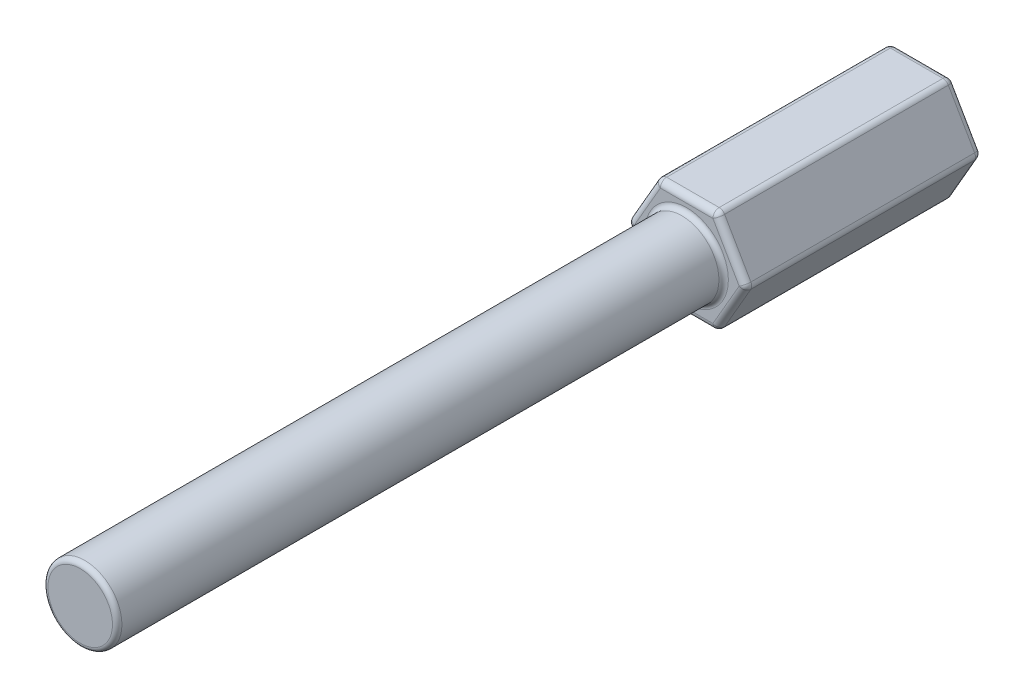
ISO-10303-21;
HEADER;
FILE_DESCRIPTION(('STEP AP214'),'2;1');
FILE_NAME('part.step','',(''),(''),'','','');
FILE_SCHEMA(('AUTOMOTIVE_DESIGN { 1 0 10303 214 1 1 1 1 }'));
ENDSEC;
DATA;
#1=APPLICATION_CONTEXT('core data for automotive mechanical design processes');
#2=APPLICATION_PROTOCOL_DEFINITION('international standard','automotive_design',2000,#1);
#3=PRODUCT_CONTEXT('',#1,'mechanical');
#4=PRODUCT('Part','Part','',(#3));
#5=PRODUCT_RELATED_PRODUCT_CATEGORY('part','',(#4));
#6=PRODUCT_DEFINITION_FORMATION('','',#4);
#7=PRODUCT_DEFINITION_CONTEXT('part definition',#1,'design');
#8=PRODUCT_DEFINITION('design','',#6,#7);
#9=PRODUCT_DEFINITION_SHAPE('','',#8);
#10=(LENGTH_UNIT() NAMED_UNIT(*) SI_UNIT(.MILLI.,.METRE.));
#11=(NAMED_UNIT(*) PLANE_ANGLE_UNIT() SI_UNIT($,.RADIAN.));
#12=(NAMED_UNIT(*) SI_UNIT($,.STERADIAN.) SOLID_ANGLE_UNIT());
#13=UNCERTAINTY_MEASURE_WITH_UNIT(LENGTH_MEASURE(1.E-05),#10,'distance_accuracy_value','');
#14=(GEOMETRIC_REPRESENTATION_CONTEXT(3) GLOBAL_UNCERTAINTY_ASSIGNED_CONTEXT((#13)) GLOBAL_UNIT_ASSIGNED_CONTEXT((#10,
#11,#12)) REPRESENTATION_CONTEXT('',''));
#15=CARTESIAN_POINT('',(0.,0.,0.));
#16=DIRECTION('',(0.,0.,1.));
#17=DIRECTION('',(1.,0.,0.));
#18=AXIS2_PLACEMENT_3D('',#15,#16,#17);
#19=CARTESIAN_POINT('',(-2.41050954265034,-4.175125,19.05));
#20=DIRECTION('',(0.,1.,0.));
#21=DIRECTION('',(-1.,0.,0.));
#22=AXIS2_PLACEMENT_3D('',#19,#20,#21);
#23=PLANE('',#22);
#24=DIRECTION('',(1.,0.,0.));
#25=VECTOR('',#24,1.);
#26=CARTESIAN_POINT('',(-2.41050954265034,-4.175125,0.508000000000002));
#27=LINE('',#26,#25);
#28=CARTESIAN_POINT('',(-2.11721560590201,-4.175125,0.508000000000002));
#29=VERTEX_POINT('',#28);
#30=CARTESIAN_POINT('',(2.11721560590201,-4.175125,0.508000000000002));
#31=VERTEX_POINT('',#30);
#32=EDGE_CURVE('E403',#29,#31,#27,.T.);
#33=ORIENTED_EDGE('',*,*,#32,.T.);
#34=DIRECTION('',(0.,0.,-1.));
#35=VECTOR('',#34,1.);
#36=CARTESIAN_POINT('',(2.11721560590201,-4.175125,19.05));
#37=LINE('',#36,#35);
#38=CARTESIAN_POINT('',(2.11721560590201,-4.175125,18.542));
#39=VERTEX_POINT('',#38);
#40=EDGE_CURVE('E217',#31,#39,#37,.F.);
#41=ORIENTED_EDGE('',*,*,#40,.T.);
#42=DIRECTION('',(1.,0.,0.));
#43=VECTOR('',#42,1.);
#44=CARTESIAN_POINT('',(-2.41050954265034,-4.175125,18.542));
#45=LINE('',#44,#43);
#46=CARTESIAN_POINT('',(-2.11721560590201,-4.175125,18.542));
#47=VERTEX_POINT('',#46);
#48=EDGE_CURVE('E361',#39,#47,#45,.F.);
#49=ORIENTED_EDGE('',*,*,#48,.T.);
#50=DIRECTION('',(0.,0.,-1.));
#51=VECTOR('',#50,1.);
#52=CARTESIAN_POINT('',(-2.11721560590201,-4.175125,19.05));
#53=LINE('',#52,#51);
#54=EDGE_CURVE('E215',#47,#29,#53,.T.);
#55=ORIENTED_EDGE('',*,*,#54,.T.);
#56=EDGE_LOOP('',(#33,#41,#49,#55));
#57=FACE_BOUND('',#56,.T.);
#58=ADVANCED_FACE('F36',(#57),#23,.F.);
#59=CARTESIAN_POINT('',(2.41050954265034,-4.175125,19.05));
#60=DIRECTION('',(-0.866025403784439,0.5,0.));
#61=DIRECTION('',(-0.5,-0.866025403784439,0.));
#62=AXIS2_PLACEMENT_3D('',#59,#60,#61);
#63=PLANE('',#62);
#64=DIRECTION('',(0.5,0.866025403784439,0.));
#65=VECTOR('',#64,1.);
#66=CARTESIAN_POINT('',(2.41050954265034,-4.175125,0.508000000000002));
#67=LINE('',#66,#65);
#68=CARTESIAN_POINT('',(2.5571565110245,-3.921125,0.508000000000002));
#69=VERTEX_POINT('',#68);
#70=CARTESIAN_POINT('',(4.67437211692651,-0.253999999999999,0.508000000000002));
#71=VERTEX_POINT('',#70);
#72=EDGE_CURVE('E193',#69,#71,#67,.T.);
#73=ORIENTED_EDGE('',*,*,#72,.T.);
#74=DIRECTION('',(0.,0.,-1.));
#75=VECTOR('',#74,1.);
#76=CARTESIAN_POINT('',(4.67437211692651,-0.254,19.05));
#77=LINE('',#76,#75);
#78=CARTESIAN_POINT('',(4.67437211692651,-0.253999999999999,18.542));
#79=VERTEX_POINT('',#78);
#80=EDGE_CURVE('E213',#71,#79,#77,.F.);
#81=ORIENTED_EDGE('',*,*,#80,.T.);
#82=DIRECTION('',(0.5,0.866025403784439,0.));
#83=VECTOR('',#82,1.);
#84=CARTESIAN_POINT('',(2.41050954265034,-4.175125,18.542));
#85=LINE('',#84,#83);
#86=CARTESIAN_POINT('',(2.5571565110245,-3.921125,18.542));
#87=VERTEX_POINT('',#86);
#88=EDGE_CURVE('E378',#79,#87,#85,.F.);
#89=ORIENTED_EDGE('',*,*,#88,.T.);
#90=DIRECTION('',(0.,0.,-1.));
#91=VECTOR('',#90,1.);
#92=CARTESIAN_POINT('',(2.5571565110245,-3.921125,19.05));
#93=LINE('',#92,#91);
#94=EDGE_CURVE('E211',#87,#69,#93,.T.);
#95=ORIENTED_EDGE('',*,*,#94,.T.);
#96=EDGE_LOOP('',(#73,#81,#89,#95));
#97=FACE_BOUND('',#96,.T.);
#98=ADVANCED_FACE('F380',(#97),#63,.F.);
#99=CARTESIAN_POINT('',(4.82101908530067,0.,19.05));
#100=DIRECTION('',(-0.866025403784439,-0.5,0.));
#101=DIRECTION('',(0.5,-0.866025403784439,0.));
#102=AXIS2_PLACEMENT_3D('',#99,#100,#101);
#103=PLANE('',#102);
#104=DIRECTION('',(-0.5,0.866025403784439,0.));
#105=VECTOR('',#104,1.);
#106=CARTESIAN_POINT('',(4.82101908530067,0.,0.508000000000002));
#107=LINE('',#106,#105);
#108=CARTESIAN_POINT('',(4.67437211692651,0.254,0.508000000000002));
#109=VERTEX_POINT('',#108);
#110=CARTESIAN_POINT('',(2.5571565110245,3.921125,0.508000000000002));
#111=VERTEX_POINT('',#110);
#112=EDGE_CURVE('E399',#109,#111,#107,.T.);
#113=ORIENTED_EDGE('',*,*,#112,.T.);
#114=DIRECTION('',(0.,0.,-1.));
#115=VECTOR('',#114,1.);
#116=CARTESIAN_POINT('',(2.5571565110245,3.921125,19.05));
#117=LINE('',#116,#115);
#118=CARTESIAN_POINT('',(2.5571565110245,3.921125,18.542));
#119=VERTEX_POINT('',#118);
#120=EDGE_CURVE('E209',#111,#119,#117,.F.);
#121=ORIENTED_EDGE('',*,*,#120,.T.);
#122=DIRECTION('',(-0.5,0.866025403784439,0.));
#123=VECTOR('',#122,1.);
#124=CARTESIAN_POINT('',(4.82101908530067,0.,18.542));
#125=LINE('',#124,#123);
#126=CARTESIAN_POINT('',(4.67437211692651,0.254,18.542));
#127=VERTEX_POINT('',#126);
#128=EDGE_CURVE('E396',#119,#127,#125,.F.);
#129=ORIENTED_EDGE('',*,*,#128,.T.);
#130=DIRECTION('',(0.,0.,-1.));
#131=VECTOR('',#130,1.);
#132=CARTESIAN_POINT('',(4.67437211692651,0.254,19.05));
#133=LINE('',#132,#131);
#134=EDGE_CURVE('E207',#127,#109,#133,.T.);
#135=ORIENTED_EDGE('',*,*,#134,.T.);
#136=EDGE_LOOP('',(#113,#121,#129,#135));
#137=FACE_BOUND('',#136,.T.);
#138=ADVANCED_FACE('F447',(#137),#103,.F.);
#139=CARTESIAN_POINT('',(2.41050954265034,4.175125,19.05));
#140=DIRECTION('',(0.,-1.,0.));
#141=DIRECTION('',(1.,0.,0.));
#142=AXIS2_PLACEMENT_3D('',#139,#140,#141);
#143=PLANE('',#142);
#144=DIRECTION('',(-1.,0.,0.));
#145=VECTOR('',#144,1.);
#146=CARTESIAN_POINT('',(2.41050954265034,4.175125,18.542));
#147=LINE('',#146,#145);
#148=CARTESIAN_POINT('',(-2.11721560590201,4.175125,18.542));
#149=VERTEX_POINT('',#148);
#150=CARTESIAN_POINT('',(2.11721560590201,4.175125,18.542));
#151=VERTEX_POINT('',#150);
#152=EDGE_CURVE('E406',#149,#151,#147,.F.);
#153=ORIENTED_EDGE('',*,*,#152,.T.);
#154=DIRECTION('',(0.,0.,-1.));
#155=VECTOR('',#154,1.);
#156=CARTESIAN_POINT('',(2.11721560590201,4.175125,19.05));
#157=LINE('',#156,#155);
#158=CARTESIAN_POINT('',(2.11721560590201,4.175125,0.508000000000002));
#159=VERTEX_POINT('',#158);
#160=EDGE_CURVE('E205',#151,#159,#157,.T.);
#161=ORIENTED_EDGE('',*,*,#160,.T.);
#162=DIRECTION('',(-1.,0.,0.));
#163=VECTOR('',#162,1.);
#164=CARTESIAN_POINT('',(2.41050954265034,4.175125,0.508000000000002));
#165=LINE('',#164,#163);
#166=CARTESIAN_POINT('',(-2.11721560590201,4.175125,0.508000000000002));
#167=VERTEX_POINT('',#166);
#168=EDGE_CURVE('E409',#159,#167,#165,.T.);
#169=ORIENTED_EDGE('',*,*,#168,.T.);
#170=DIRECTION('',(0.,0.,-1.));
#171=VECTOR('',#170,1.);
#172=CARTESIAN_POINT('',(-2.11721560590201,4.175125,19.05));
#173=LINE('',#172,#171);
#174=EDGE_CURVE('E198',#167,#149,#173,.F.);
#175=ORIENTED_EDGE('',*,*,#174,.T.);
#176=EDGE_LOOP('',(#153,#161,#169,#175));
#177=FACE_BOUND('',#176,.T.);
#178=ADVANCED_FACE('F414',(#177),#143,.F.);
#179=CARTESIAN_POINT('',(-2.41050954265034,4.175125,19.05));
#180=DIRECTION('',(0.866025403784439,-0.5,0.));
#181=DIRECTION('',(0.5,0.866025403784439,0.));
#182=AXIS2_PLACEMENT_3D('',#179,#180,#181);
#183=PLANE('',#182);
#184=DIRECTION('',(-0.5,-0.866025403784439,0.));
#185=VECTOR('',#184,1.);
#186=CARTESIAN_POINT('',(-2.41050954265034,4.175125,18.542));
#187=LINE('',#186,#185);
#188=CARTESIAN_POINT('',(-4.67437211692651,0.254000000000002,18.542));
#189=VERTEX_POINT('',#188);
#190=CARTESIAN_POINT('',(-2.5571565110245,3.921125,18.542));
#191=VERTEX_POINT('',#190);
#192=EDGE_CURVE('E261',#189,#191,#187,.F.);
#193=ORIENTED_EDGE('',*,*,#192,.T.);
#194=DIRECTION('',(0.,0.,-1.));
#195=VECTOR('',#194,1.);
#196=CARTESIAN_POINT('',(-2.5571565110245,3.921125,19.05));
#197=LINE('',#196,#195);
#198=CARTESIAN_POINT('',(-2.5571565110245,3.921125,0.508000000000002));
#199=VERTEX_POINT('',#198);
#200=EDGE_CURVE('E11',#191,#199,#197,.T.);
#201=ORIENTED_EDGE('',*,*,#200,.T.);
#202=DIRECTION('',(-0.5,-0.866025403784439,0.));
#203=VECTOR('',#202,1.);
#204=CARTESIAN_POINT('',(-2.41050954265034,4.175125,0.508000000000002));
#205=LINE('',#204,#203);
#206=CARTESIAN_POINT('',(-4.67437211692651,0.254000000000002,0.508000000000002));
#207=VERTEX_POINT('',#206);
#208=EDGE_CURVE('E262',#199,#207,#205,.T.);
#209=ORIENTED_EDGE('',*,*,#208,.T.);
#210=DIRECTION('',(0.,0.,-1.));
#211=VECTOR('',#210,1.);
#212=CARTESIAN_POINT('',(-4.67437211692651,0.254000000000002,19.05));
#213=LINE('',#212,#211);
#214=EDGE_CURVE('E45',#207,#189,#213,.F.);
#215=ORIENTED_EDGE('',*,*,#214,.T.);
#216=EDGE_LOOP('',(#193,#201,#209,#215));
#217=FACE_BOUND('',#216,.T.);
#218=ADVANCED_FACE('F260',(#217),#183,.F.);
#219=CARTESIAN_POINT('',(-4.82101908530067,0.,19.05));
#220=DIRECTION('',(0.866025403784439,0.5,0.));
#221=DIRECTION('',(-0.5,0.866025403784439,0.));
#222=AXIS2_PLACEMENT_3D('',#219,#220,#221);
#223=PLANE('',#222);
#224=DIRECTION('',(0.5,-0.866025403784439,0.));
#225=VECTOR('',#224,1.);
#226=CARTESIAN_POINT('',(-4.82101908530067,0.,0.508000000000002));
#227=LINE('',#226,#225);
#228=CARTESIAN_POINT('',(-4.67437211692651,-0.253999999999998,0.508000000000002));
#229=VERTEX_POINT('',#228);
#230=CARTESIAN_POINT('',(-2.5571565110245,-3.921125,0.508000000000002));
#231=VERTEX_POINT('',#230);
#232=EDGE_CURVE('E170',#229,#231,#227,.T.);
#233=ORIENTED_EDGE('',*,*,#232,.T.);
#234=DIRECTION('',(0.,0.,-1.));
#235=VECTOR('',#234,1.);
#236=CARTESIAN_POINT('',(-2.5571565110245,-3.921125,19.05));
#237=LINE('',#236,#235);
#238=CARTESIAN_POINT('',(-2.5571565110245,-3.921125,18.542));
#239=VERTEX_POINT('',#238);
#240=EDGE_CURVE('E221',#231,#239,#237,.F.);
#241=ORIENTED_EDGE('',*,*,#240,.T.);
#242=DIRECTION('',(0.5,-0.866025403784439,0.));
#243=VECTOR('',#242,1.);
#244=CARTESIAN_POINT('',(-4.82101908530067,0.,18.542));
#245=LINE('',#244,#243);
#246=CARTESIAN_POINT('',(-4.67437211692651,-0.253999999999998,18.542));
#247=VERTEX_POINT('',#246);
#248=EDGE_CURVE('E271',#239,#247,#245,.F.);
#249=ORIENTED_EDGE('',*,*,#248,.T.);
#250=DIRECTION('',(0.,0.,-1.));
#251=VECTOR('',#250,1.);
#252=CARTESIAN_POINT('',(-4.67437211692651,-0.253999999999998,19.05));
#253=LINE('',#252,#251);
#254=EDGE_CURVE('E219',#247,#229,#253,.T.);
#255=ORIENTED_EDGE('',*,*,#254,.T.);
#256=EDGE_LOOP('',(#233,#241,#249,#255));
#257=FACE_BOUND('',#256,.T.);
#258=ADVANCED_FACE('F335',(#257),#223,.F.);
#259=CARTESIAN_POINT('',(0.,0.,19.05));
#260=DIRECTION('',(0.,0.,1.));
#261=DIRECTION('',(1.,0.,0.));
#262=AXIS2_PLACEMENT_3D('',#259,#260,#261);
#263=PLANE('',#262);
#264=DIRECTION('',(1.,0.,0.));
#265=VECTOR('',#264,1.);
#266=CARTESIAN_POINT('',(2.41050954265034,-3.667125,19.05));
#267=LINE('',#266,#265);
#268=CARTESIAN_POINT('',(-2.11721560590201,-3.667125,19.05));
#269=VERTEX_POINT('',#268);
#270=CARTESIAN_POINT('',(2.11721560590201,-3.667125,19.05));
#271=VERTEX_POINT('',#270);
#272=EDGE_CURVE('E282',#269,#271,#267,.T.);
#273=ORIENTED_EDGE('',*,*,#272,.T.);
#274=DIRECTION('',(0.5,0.866025403784439,0.));
#275=VECTOR('',#274,1.);
#276=CARTESIAN_POINT('',(4.38107818017818,0.254000000000001,19.05));
#277=LINE('',#276,#275);
#278=CARTESIAN_POINT('',(4.23443121180401,0.,19.05));
#279=VERTEX_POINT('',#278);
#280=EDGE_CURVE('E288',#271,#279,#277,.T.);
#281=ORIENTED_EDGE('',*,*,#280,.T.);
#282=DIRECTION('',(-0.5,0.866025403784439,0.));
#283=VECTOR('',#282,1.);
#284=CARTESIAN_POINT('',(1.97056863752784,3.921125,19.05));
#285=LINE('',#284,#283);
#286=CARTESIAN_POINT('',(2.11721560590201,3.667125,19.05));
#287=VERTEX_POINT('',#286);
#288=EDGE_CURVE('E285',#279,#287,#285,.T.);
#289=ORIENTED_EDGE('',*,*,#288,.T.);
#290=DIRECTION('',(-1.,0.,0.));
#291=VECTOR('',#290,1.);
#292=CARTESIAN_POINT('',(-2.41050954265034,3.667125,19.05));
#293=LINE('',#292,#291);
#294=CARTESIAN_POINT('',(-2.11721560590201,3.667125,19.05));
#295=VERTEX_POINT('',#294);
#296=EDGE_CURVE('E279',#287,#295,#293,.T.);
#297=ORIENTED_EDGE('',*,*,#296,.T.);
#298=DIRECTION('',(-0.5,-0.866025403784439,0.));
#299=VECTOR('',#298,1.);
#300=CARTESIAN_POINT('',(-4.38107818017818,-0.253999999999998,19.05));
#301=LINE('',#300,#299);
#302=CARTESIAN_POINT('',(-4.23443121180401,0.,19.05));
#303=VERTEX_POINT('',#302);
#304=EDGE_CURVE('E277',#295,#303,#301,.T.);
#305=ORIENTED_EDGE('',*,*,#304,.T.);
#306=DIRECTION('',(0.5,-0.866025403784439,0.));
#307=VECTOR('',#306,1.);
#308=CARTESIAN_POINT('',(-1.97056863752784,-3.921125,19.05));
#309=LINE('',#308,#307);
#310=EDGE_CURVE('E269',#303,#269,#309,.T.);
#311=ORIENTED_EDGE('',*,*,#310,.T.);
#312=EDGE_LOOP('',(#273,#281,#289,#297,#305,#311));
#313=FACE_BOUND('',#312,.T.);
#314=CARTESIAN_POINT('',(0.,0.,19.05));
#315=DIRECTION('',(0.,0.,1.));
#316=DIRECTION('',(1.,0.,0.));
#317=AXIS2_PLACEMENT_3D('',#314,#315,#316);
#318=CIRCLE('',#317,3.3655);
#319=CARTESIAN_POINT('',(3.3655,0.,19.05));
#320=VERTEX_POINT('',#319);
#321=EDGE_CURVE('E382',#320,#320,#318,.F.);
#322=ORIENTED_EDGE('',*,*,#321,.T.);
#323=EDGE_LOOP('',(#322));
#324=FACE_BOUND('',#323,.T.);
#325=ADVANCED_FACE('F353',(#313,#324),#263,.T.);
#326=CARTESIAN_POINT('',(0.,0.,0.));
#327=DIRECTION('',(0.,0.,1.));
#328=DIRECTION('',(1.,0.,0.));
#329=AXIS2_PLACEMENT_3D('',#326,#327,#328);
#330=PLANE('',#329);
#331=DIRECTION('',(-0.5,0.866025403784439,0.));
#332=VECTOR('',#331,1.);
#333=CARTESIAN_POINT('',(3.17582340885301,1.8335625,0.));
#334=LINE('',#333,#332);
#335=CARTESIAN_POINT('',(2.11721560590201,3.667125,0.));
#336=VERTEX_POINT('',#335);
#337=CARTESIAN_POINT('',(4.23443121180401,0.,0.));
#338=VERTEX_POINT('',#337);
#339=EDGE_CURVE('E392',#336,#338,#334,.F.);
#340=ORIENTED_EDGE('',*,*,#339,.T.);
#341=DIRECTION('',(0.5,0.866025403784439,0.));
#342=VECTOR('',#341,1.);
#343=CARTESIAN_POINT('',(3.17582340885301,-1.8335625,0.));
#344=LINE('',#343,#342);
#345=CARTESIAN_POINT('',(2.11721560590201,-3.667125,0.));
#346=VERTEX_POINT('',#345);
#347=EDGE_CURVE('E394',#338,#346,#344,.F.);
#348=ORIENTED_EDGE('',*,*,#347,.T.);
#349=DIRECTION('',(1.,0.,0.));
#350=VECTOR('',#349,1.);
#351=CARTESIAN_POINT('',(0.,-3.667125,0.));
#352=LINE('',#351,#350);
#353=CARTESIAN_POINT('',(-2.11721560590201,-3.667125,0.));
#354=VERTEX_POINT('',#353);
#355=EDGE_CURVE('E187',#346,#354,#352,.F.);
#356=ORIENTED_EDGE('',*,*,#355,.T.);
#357=DIRECTION('',(0.5,-0.866025403784439,0.));
#358=VECTOR('',#357,1.);
#359=CARTESIAN_POINT('',(-3.17582340885301,-1.8335625,0.));
#360=LINE('',#359,#358);
#361=CARTESIAN_POINT('',(-4.23443121180401,0.,0.));
#362=VERTEX_POINT('',#361);
#363=EDGE_CURVE('E167',#354,#362,#360,.F.);
#364=ORIENTED_EDGE('',*,*,#363,.T.);
#365=DIRECTION('',(-0.5,-0.866025403784439,0.));
#366=VECTOR('',#365,1.);
#367=CARTESIAN_POINT('',(-3.17582340885301,1.8335625,0.));
#368=LINE('',#367,#366);
#369=CARTESIAN_POINT('',(-2.11721560590201,3.667125,0.));
#370=VERTEX_POINT('',#369);
#371=EDGE_CURVE('E183',#362,#370,#368,.F.);
#372=ORIENTED_EDGE('',*,*,#371,.T.);
#373=DIRECTION('',(-1.,0.,0.));
#374=VECTOR('',#373,1.);
#375=CARTESIAN_POINT('',(0.,3.667125,0.));
#376=LINE('',#375,#374);
#377=EDGE_CURVE('E188',#370,#336,#376,.F.);
#378=ORIENTED_EDGE('',*,*,#377,.T.);
#379=EDGE_LOOP('',(#340,#348,#356,#364,#372,#378));
#380=FACE_BOUND('',#379,.T.);
#381=ADVANCED_FACE('F181',(#380),#330,.F.);
#382=CARTESIAN_POINT('',(0.,0.,67.945));
#383=DIRECTION('',(0.,0.,-1.));
#384=DIRECTION('',(-1.,0.,0.));
#385=AXIS2_PLACEMENT_3D('',#382,#383,#384);
#386=CYLINDRICAL_SURFACE('',#385,2.9845);
#387=CARTESIAN_POINT('',(0.,0.,19.431));
#388=DIRECTION('',(0.,0.,1.));
#389=DIRECTION('',(1.,0.,0.));
#390=AXIS2_PLACEMENT_3D('',#387,#388,#389);
#391=CIRCLE('',#390,2.9845);
#392=CARTESIAN_POINT('',(2.9845,0.,19.431));
#393=VERTEX_POINT('',#392);
#394=EDGE_CURVE('E386',#393,#393,#391,.T.);
#395=ORIENTED_EDGE('',*,*,#394,.T.);
#396=EDGE_LOOP('',(#395));
#397=FACE_BOUND('',#396,.T.);
#398=CARTESIAN_POINT('',(0.,0.,67.564));
#399=DIRECTION('',(0.,0.,1.));
#400=DIRECTION('',(1.,0.,0.));
#401=AXIS2_PLACEMENT_3D('',#398,#399,#400);
#402=CIRCLE('',#401,2.9845);
#403=CARTESIAN_POINT('',(2.9845,0.,67.564));
#404=VERTEX_POINT('',#403);
#405=EDGE_CURVE('E847',#404,#404,#402,.F.);
#406=ORIENTED_EDGE('',*,*,#405,.T.);
#407=EDGE_LOOP('',(#406));
#408=FACE_BOUND('',#407,.T.);
#409=ADVANCED_FACE('F678',(#397,#408),#386,.T.);
#410=CARTESIAN_POINT('',(0.,0.,67.945));
#411=DIRECTION('',(0.,0.,1.));
#412=DIRECTION('',(1.,0.,0.));
#413=AXIS2_PLACEMENT_3D('',#410,#411,#412);
#414=PLANE('',#413);
#415=CARTESIAN_POINT('',(0.,0.,67.945));
#416=DIRECTION('',(0.,0.,1.));
#417=DIRECTION('',(1.,0.,0.));
#418=AXIS2_PLACEMENT_3D('',#415,#416,#417);
#419=CIRCLE('',#418,2.6035);
#420=CARTESIAN_POINT('',(2.6035,0.,67.945));
#421=VERTEX_POINT('',#420);
#422=EDGE_CURVE('E231',#421,#421,#419,.T.);
#423=ORIENTED_EDGE('',*,*,#422,.T.);
#424=EDGE_LOOP('',(#423));
#425=FACE_BOUND('',#424,.T.);
#426=ADVANCED_FACE('F480',(#425),#414,.T.);
#427=CARTESIAN_POINT('',(0.,0.,67.564));
#428=DIRECTION('',(0.,0.,1.));
#429=DIRECTION('',(1.,0.,0.));
#430=AXIS2_PLACEMENT_3D('',#427,#428,#429);
#431=TOROIDAL_SURFACE('',#430,2.6035,0.381);
#432=ORIENTED_EDGE('',*,*,#405,.F.);
#433=EDGE_LOOP('',(#432));
#434=FACE_BOUND('',#433,.T.);
#435=ORIENTED_EDGE('',*,*,#422,.F.);
#436=EDGE_LOOP('',(#435));
#437=FACE_BOUND('',#436,.T.);
#438=ADVANCED_FACE('F476',(#434,#437),#431,.T.);
#439=CARTESIAN_POINT('',(0.,0.,19.431));
#440=DIRECTION('',(0.,0.,1.));
#441=DIRECTION('',(1.,0.,0.));
#442=AXIS2_PLACEMENT_3D('',#439,#440,#441);
#443=TOROIDAL_SURFACE('',#442,3.3655,0.381);
#444=ORIENTED_EDGE('',*,*,#321,.F.);
#445=EDGE_LOOP('',(#444));
#446=FACE_BOUND('',#445,.T.);
#447=ORIENTED_EDGE('',*,*,#394,.F.);
#448=EDGE_LOOP('',(#447));
#449=FACE_BOUND('',#448,.T.);
#450=ADVANCED_FACE('F479',(#446,#449),#443,.F.);
#451=CARTESIAN_POINT('',(-1.97056863752784,3.921125,0.508000000000002));
#452=DIRECTION('',(-0.5,-0.866025403784439,0.));
#453=DIRECTION('',(0.866025403784439,-0.5,0.));
#454=AXIS2_PLACEMENT_3D('',#451,#452,#453);
#455=CYLINDRICAL_SURFACE('',#454,0.508);
#456=ORIENTED_EDGE('',*,*,#208,.F.);
#457=CARTESIAN_POINT('',(-2.11721560590201,3.667125,0.508000000000002));
#458=DIRECTION('',(-0.5,-0.866025403784439,0.));
#459=DIRECTION('',(0.866025403784439,-0.5,0.));
#460=AXIS2_PLACEMENT_3D('',#457,#458,#459);
#461=CIRCLE('',#460,0.508);
#462=EDGE_CURVE('E192',#199,#370,#461,.T.);
#463=ORIENTED_EDGE('',*,*,#462,.T.);
#464=ORIENTED_EDGE('',*,*,#371,.F.);
#465=CARTESIAN_POINT('',(-4.23443121180401,0.,0.508000000000002));
#466=DIRECTION('',(-0.5,-0.866025403784439,0.));
#467=DIRECTION('',(0.866025403784439,-0.5,0.));
#468=AXIS2_PLACEMENT_3D('',#465,#466,#467);
#469=CIRCLE('',#468,0.508);
#470=EDGE_CURVE('E53',#362,#207,#469,.F.);
#471=ORIENTED_EDGE('',*,*,#470,.T.);
#472=EDGE_LOOP('',(#456,#463,#464,#471));
#473=FACE_BOUND('',#472,.T.);
#474=ADVANCED_FACE('F190',(#473),#455,.T.);
#475=CARTESIAN_POINT('',(-4.38107818017818,0.254000000000002,0.508000000000002));
#476=DIRECTION('',(0.5,-0.866025403784439,0.));
#477=DIRECTION('',(0.866025403784439,0.5,0.));
#478=AXIS2_PLACEMENT_3D('',#475,#476,#477);
#479=CYLINDRICAL_SURFACE('',#478,0.508);
#480=ORIENTED_EDGE('',*,*,#363,.F.);
#481=CARTESIAN_POINT('',(-2.11721560590201,-3.667125,0.508000000000002));
#482=DIRECTION('',(0.5,-0.866025403784439,0.));
#483=DIRECTION('',(0.866025403784439,0.5,0.));
#484=AXIS2_PLACEMENT_3D('',#481,#482,#483);
#485=CIRCLE('',#484,0.508);
#486=EDGE_CURVE('E174',#354,#231,#485,.F.);
#487=ORIENTED_EDGE('',*,*,#486,.T.);
#488=ORIENTED_EDGE('',*,*,#232,.F.);
#489=CARTESIAN_POINT('',(-4.23443121180401,0.,0.508000000000002));
#490=DIRECTION('',(0.5,-0.866025403784439,0.));
#491=DIRECTION('',(0.866025403784439,0.5,0.));
#492=AXIS2_PLACEMENT_3D('',#489,#490,#491);
#493=CIRCLE('',#492,0.508);
#494=EDGE_CURVE('E164',#229,#362,#493,.T.);
#495=ORIENTED_EDGE('',*,*,#494,.T.);
#496=EDGE_LOOP('',(#480,#487,#488,#495));
#497=FACE_BOUND('',#496,.T.);
#498=ADVANCED_FACE('F166',(#497),#479,.T.);
#499=CARTESIAN_POINT('',(2.41050954265034,3.667125,0.508000000000002));
#500=DIRECTION('',(-1.,0.,0.));
#501=DIRECTION('',(0.,-1.,0.));
#502=AXIS2_PLACEMENT_3D('',#499,#500,#501);
#503=CYLINDRICAL_SURFACE('',#502,0.508);
#504=ORIENTED_EDGE('',*,*,#168,.F.);
#505=CARTESIAN_POINT('',(2.11721560590201,3.667125,0.508000000000002));
#506=DIRECTION('',(-1.,0.,0.));
#507=DIRECTION('',(0.,-1.,0.));
#508=AXIS2_PLACEMENT_3D('',#505,#506,#507);
#509=CIRCLE('',#508,0.508);
#510=EDGE_CURVE('E308',#159,#336,#509,.T.);
#511=ORIENTED_EDGE('',*,*,#510,.T.);
#512=ORIENTED_EDGE('',*,*,#377,.F.);
#513=CARTESIAN_POINT('',(-2.11721560590201,3.667125,0.508000000000002));
#514=DIRECTION('',(-1.,0.,0.));
#515=DIRECTION('',(0.,-1.,0.));
#516=AXIS2_PLACEMENT_3D('',#513,#514,#515);
#517=CIRCLE('',#516,0.508);
#518=EDGE_CURVE('E306',#370,#167,#517,.F.);
#519=ORIENTED_EDGE('',*,*,#518,.T.);
#520=EDGE_LOOP('',(#504,#511,#512,#519));
#521=FACE_BOUND('',#520,.T.);
#522=ADVANCED_FACE('F491',(#521),#503,.T.);
#523=CARTESIAN_POINT('',(-2.41050954265034,-3.667125,0.508000000000002));
#524=DIRECTION('',(1.,0.,0.));
#525=DIRECTION('',(0.,1.,0.));
#526=AXIS2_PLACEMENT_3D('',#523,#524,#525);
#527=CYLINDRICAL_SURFACE('',#526,0.508);
#528=ORIENTED_EDGE('',*,*,#355,.F.);
#529=CARTESIAN_POINT('',(2.11721560590201,-3.667125,0.508000000000002));
#530=DIRECTION('',(1.,0.,0.));
#531=DIRECTION('',(0.,1.,0.));
#532=AXIS2_PLACEMENT_3D('',#529,#530,#531);
#533=CIRCLE('',#532,0.508);
#534=EDGE_CURVE('E326',#346,#31,#533,.F.);
#535=ORIENTED_EDGE('',*,*,#534,.T.);
#536=ORIENTED_EDGE('',*,*,#32,.F.);
#537=CARTESIAN_POINT('',(-2.11721560590201,-3.667125,0.508000000000002));
#538=DIRECTION('',(1.,0.,0.));
#539=DIRECTION('',(0.,1.,0.));
#540=AXIS2_PLACEMENT_3D('',#537,#538,#539);
#541=CIRCLE('',#540,0.508);
#542=EDGE_CURVE('E324',#29,#354,#541,.T.);
#543=ORIENTED_EDGE('',*,*,#542,.T.);
#544=EDGE_LOOP('',(#528,#535,#536,#543));
#545=FACE_BOUND('',#544,.T.);
#546=ADVANCED_FACE('F466',(#545),#527,.T.);
#547=CARTESIAN_POINT('',(4.38107818017818,-0.254,0.508000000000002));
#548=DIRECTION('',(-0.5,0.866025403784439,0.));
#549=DIRECTION('',(-0.866025403784439,-0.5,0.));
#550=AXIS2_PLACEMENT_3D('',#547,#548,#549);
#551=CYLINDRICAL_SURFACE('',#550,0.508);
#552=ORIENTED_EDGE('',*,*,#339,.F.);
#553=CARTESIAN_POINT('',(2.11721560590201,3.667125,0.508000000000002));
#554=DIRECTION('',(-0.5,0.866025403784439,0.));
#555=DIRECTION('',(-0.866025403784439,-0.5,0.));
#556=AXIS2_PLACEMENT_3D('',#553,#554,#555);
#557=CIRCLE('',#556,0.508);
#558=EDGE_CURVE('E304',#336,#111,#557,.F.);
#559=ORIENTED_EDGE('',*,*,#558,.T.);
#560=ORIENTED_EDGE('',*,*,#112,.F.);
#561=CARTESIAN_POINT('',(4.23443121180401,0.,0.508000000000002));
#562=DIRECTION('',(-0.5,0.866025403784439,0.));
#563=DIRECTION('',(-0.866025403784439,-0.5,0.));
#564=AXIS2_PLACEMENT_3D('',#561,#562,#563);
#565=CIRCLE('',#564,0.508);
#566=EDGE_CURVE('E302',#109,#338,#565,.T.);
#567=ORIENTED_EDGE('',*,*,#566,.T.);
#568=EDGE_LOOP('',(#552,#559,#560,#567));
#569=FACE_BOUND('',#568,.T.);
#570=ADVANCED_FACE('F452',(#569),#551,.T.);
#571=CARTESIAN_POINT('',(1.97056863752784,-3.921125,0.508000000000002));
#572=DIRECTION('',(0.5,0.866025403784439,0.));
#573=DIRECTION('',(-0.866025403784439,0.5,0.));
#574=AXIS2_PLACEMENT_3D('',#571,#572,#573);
#575=CYLINDRICAL_SURFACE('',#574,0.508);
#576=ORIENTED_EDGE('',*,*,#347,.F.);
#577=CARTESIAN_POINT('',(4.23443121180401,0.,0.508000000000002));
#578=DIRECTION('',(0.5,0.866025403784439,0.));
#579=DIRECTION('',(-0.866025403784439,0.5,0.));
#580=AXIS2_PLACEMENT_3D('',#577,#578,#579);
#581=CIRCLE('',#580,0.508);
#582=EDGE_CURVE('E317',#338,#71,#581,.F.);
#583=ORIENTED_EDGE('',*,*,#582,.T.);
#584=ORIENTED_EDGE('',*,*,#72,.F.);
#585=CARTESIAN_POINT('',(2.11721560590201,-3.667125,0.508000000000002));
#586=DIRECTION('',(0.5,0.866025403784439,0.));
#587=DIRECTION('',(-0.866025403784439,0.5,0.));
#588=AXIS2_PLACEMENT_3D('',#585,#586,#587);
#589=CIRCLE('',#588,0.508);
#590=EDGE_CURVE('E315',#69,#346,#589,.T.);
#591=ORIENTED_EDGE('',*,*,#590,.T.);
#592=EDGE_LOOP('',(#576,#583,#584,#591));
#593=FACE_BOUND('',#592,.T.);
#594=ADVANCED_FACE('F459',(#593),#575,.T.);
#595=CARTESIAN_POINT('',(-3.17582340885301,-1.8335625,18.542));
#596=DIRECTION('',(-0.5,0.866025403784439,0.));
#597=DIRECTION('',(-0.866025403784439,-0.5,0.));
#598=AXIS2_PLACEMENT_3D('',#595,#596,#597);
#599=CYLINDRICAL_SURFACE('',#598,0.508);
#600=ORIENTED_EDGE('',*,*,#248,.F.);
#601=CARTESIAN_POINT('',(-2.11721560590201,-3.667125,18.542));
#602=DIRECTION('',(-0.5,0.866025403784439,0.));
#603=DIRECTION('',(-0.866025403784439,-0.5,0.));
#604=AXIS2_PLACEMENT_3D('',#601,#602,#603);
#605=CIRCLE('',#604,0.508);
#606=EDGE_CURVE('E175',#239,#269,#605,.T.);
#607=ORIENTED_EDGE('',*,*,#606,.T.);
#608=ORIENTED_EDGE('',*,*,#310,.F.);
#609=CARTESIAN_POINT('',(-4.23443121180401,0.,18.542));
#610=DIRECTION('',(-0.5,0.866025403784439,0.));
#611=DIRECTION('',(-0.866025403784439,-0.5,0.));
#612=AXIS2_PLACEMENT_3D('',#609,#610,#611);
#613=CIRCLE('',#612,0.508);
#614=EDGE_CURVE('E328',#303,#247,#613,.F.);
#615=ORIENTED_EDGE('',*,*,#614,.T.);
#616=EDGE_LOOP('',(#600,#607,#608,#615));
#617=FACE_BOUND('',#616,.T.);
#618=ADVANCED_FACE('F350',(#617),#599,.T.);
#619=CARTESIAN_POINT('',(0.,-3.667125,18.542));
#620=DIRECTION('',(-1.,0.,0.));
#621=DIRECTION('',(0.,-1.,0.));
#622=AXIS2_PLACEMENT_3D('',#619,#620,#621);
#623=CYLINDRICAL_SURFACE('',#622,0.508);
#624=ORIENTED_EDGE('',*,*,#48,.F.);
#625=CARTESIAN_POINT('',(2.11721560590201,-3.667125,18.542));
#626=DIRECTION('',(-1.,0.,0.));
#627=DIRECTION('',(0.,-1.,0.));
#628=AXIS2_PLACEMENT_3D('',#625,#626,#627);
#629=CIRCLE('',#628,0.508);
#630=EDGE_CURVE('E322',#39,#271,#629,.T.);
#631=ORIENTED_EDGE('',*,*,#630,.T.);
#632=ORIENTED_EDGE('',*,*,#272,.F.);
#633=CARTESIAN_POINT('',(-2.11721560590201,-3.667125,18.542));
#634=DIRECTION('',(-1.,0.,0.));
#635=DIRECTION('',(0.,-1.,0.));
#636=AXIS2_PLACEMENT_3D('',#633,#634,#635);
#637=CIRCLE('',#636,0.508);
#638=EDGE_CURVE('E319',#269,#47,#637,.F.);
#639=ORIENTED_EDGE('',*,*,#638,.T.);
#640=EDGE_LOOP('',(#624,#631,#632,#639));
#641=FACE_BOUND('',#640,.T.);
#642=ADVANCED_FACE('F358',(#641),#623,.T.);
#643=CARTESIAN_POINT('',(-3.17582340885301,1.8335625,18.542));
#644=DIRECTION('',(0.5,0.866025403784439,0.));
#645=DIRECTION('',(-0.866025403784439,0.5,0.));
#646=AXIS2_PLACEMENT_3D('',#643,#644,#645);
#647=CYLINDRICAL_SURFACE('',#646,0.508);
#648=ORIENTED_EDGE('',*,*,#304,.F.);
#649=CARTESIAN_POINT('',(-2.11721560590201,3.667125,18.542));
#650=DIRECTION('',(0.5,0.866025403784439,0.));
#651=DIRECTION('',(-0.866025403784439,0.5,0.));
#652=AXIS2_PLACEMENT_3D('',#649,#650,#651);
#653=CIRCLE('',#652,0.508);
#654=EDGE_CURVE('E196',#295,#191,#653,.F.);
#655=ORIENTED_EDGE('',*,*,#654,.T.);
#656=ORIENTED_EDGE('',*,*,#192,.F.);
#657=CARTESIAN_POINT('',(-4.23443121180401,0.,18.542));
#658=DIRECTION('',(0.5,0.866025403784439,0.));
#659=DIRECTION('',(-0.866025403784439,0.5,0.));
#660=AXIS2_PLACEMENT_3D('',#657,#658,#659);
#661=CIRCLE('',#660,0.508);
#662=EDGE_CURVE('E200',#189,#303,#661,.T.);
#663=ORIENTED_EDGE('',*,*,#662,.T.);
#664=EDGE_LOOP('',(#648,#655,#656,#663));
#665=FACE_BOUND('',#664,.T.);
#666=ADVANCED_FACE('F266',(#665),#647,.T.);
#667=CARTESIAN_POINT('',(3.17582340885301,-1.8335625,18.542));
#668=DIRECTION('',(-0.5,-0.866025403784439,0.));
#669=DIRECTION('',(0.866025403784439,-0.5,0.));
#670=AXIS2_PLACEMENT_3D('',#667,#668,#669);
#671=CYLINDRICAL_SURFACE('',#670,0.508);
#672=ORIENTED_EDGE('',*,*,#88,.F.);
#673=CARTESIAN_POINT('',(4.23443121180401,0.,18.542));
#674=DIRECTION('',(-0.5,-0.866025403784439,0.));
#675=DIRECTION('',(0.866025403784439,-0.5,0.));
#676=AXIS2_PLACEMENT_3D('',#673,#674,#675);
#677=CIRCLE('',#676,0.508);
#678=EDGE_CURVE('E313',#79,#279,#677,.T.);
#679=ORIENTED_EDGE('',*,*,#678,.T.);
#680=ORIENTED_EDGE('',*,*,#280,.F.);
#681=CARTESIAN_POINT('',(2.11721560590201,-3.667125,18.542));
#682=DIRECTION('',(-0.5,-0.866025403784439,0.));
#683=DIRECTION('',(0.866025403784439,-0.5,0.));
#684=AXIS2_PLACEMENT_3D('',#681,#682,#683);
#685=CIRCLE('',#684,0.508);
#686=EDGE_CURVE('E310',#271,#87,#685,.F.);
#687=ORIENTED_EDGE('',*,*,#686,.T.);
#688=EDGE_LOOP('',(#672,#679,#680,#687));
#689=FACE_BOUND('',#688,.T.);
#690=ADVANCED_FACE('F377',(#689),#671,.T.);
#691=CARTESIAN_POINT('',(0.,3.667125,18.542));
#692=DIRECTION('',(1.,0.,0.));
#693=DIRECTION('',(0.,1.,0.));
#694=AXIS2_PLACEMENT_3D('',#691,#692,#693);
#695=CYLINDRICAL_SURFACE('',#694,0.508);
#696=ORIENTED_EDGE('',*,*,#296,.F.);
#697=CARTESIAN_POINT('',(2.11721560590201,3.667125,18.542));
#698=DIRECTION('',(1.,0.,0.));
#699=DIRECTION('',(0.,1.,0.));
#700=AXIS2_PLACEMENT_3D('',#697,#698,#699);
#701=CIRCLE('',#700,0.508);
#702=EDGE_CURVE('E300',#287,#151,#701,.F.);
#703=ORIENTED_EDGE('',*,*,#702,.T.);
#704=ORIENTED_EDGE('',*,*,#152,.F.);
#705=CARTESIAN_POINT('',(-2.11721560590201,3.667125,18.542));
#706=DIRECTION('',(1.,0.,0.));
#707=DIRECTION('',(0.,1.,0.));
#708=AXIS2_PLACEMENT_3D('',#705,#706,#707);
#709=CIRCLE('',#708,0.508);
#710=EDGE_CURVE('E297',#149,#295,#709,.T.);
#711=ORIENTED_EDGE('',*,*,#710,.T.);
#712=EDGE_LOOP('',(#696,#703,#704,#711));
#713=FACE_BOUND('',#712,.T.);
#714=ADVANCED_FACE('F431',(#713),#695,.T.);
#715=CARTESIAN_POINT('',(3.17582340885301,1.8335625,18.542));
#716=DIRECTION('',(0.5,-0.866025403784439,0.));
#717=DIRECTION('',(0.866025403784439,0.5,0.));
#718=AXIS2_PLACEMENT_3D('',#715,#716,#717);
#719=CYLINDRICAL_SURFACE('',#718,0.508);
#720=ORIENTED_EDGE('',*,*,#128,.F.);
#721=CARTESIAN_POINT('',(2.11721560590201,3.667125,18.542));
#722=DIRECTION('',(0.5,-0.866025403784439,0.));
#723=DIRECTION('',(0.866025403784439,0.5,0.));
#724=AXIS2_PLACEMENT_3D('',#721,#722,#723);
#725=CIRCLE('',#724,0.508);
#726=EDGE_CURVE('E294',#119,#287,#725,.T.);
#727=ORIENTED_EDGE('',*,*,#726,.T.);
#728=ORIENTED_EDGE('',*,*,#288,.F.);
#729=CARTESIAN_POINT('',(4.23443121180401,0.,18.542));
#730=DIRECTION('',(0.5,-0.866025403784439,0.));
#731=DIRECTION('',(0.866025403784439,0.5,0.));
#732=AXIS2_PLACEMENT_3D('',#729,#730,#731);
#733=CIRCLE('',#732,0.508);
#734=EDGE_CURVE('E291',#279,#127,#733,.F.);
#735=ORIENTED_EDGE('',*,*,#734,.T.);
#736=EDGE_LOOP('',(#720,#727,#728,#735));
#737=FACE_BOUND('',#736,.T.);
#738=ADVANCED_FACE('F436',(#737),#719,.T.);
#739=CARTESIAN_POINT('',(2.11721560590201,3.667125,0.508000000000002));
#740=DIRECTION('',(0.,0.,1.));
#741=DIRECTION('',(1.,0.,0.));
#742=AXIS2_PLACEMENT_3D('',#739,#740,#741);
#743=SPHERICAL_SURFACE('',#742,0.508);
#744=ORIENTED_EDGE('',*,*,#558,.F.);
#745=ORIENTED_EDGE('',*,*,#510,.F.);
#746=CARTESIAN_POINT('',(2.11721560590201,3.667125,0.508000000000002));
#747=DIRECTION('',(0.,0.,1.));
#748=DIRECTION('',(1.,0.,0.));
#749=AXIS2_PLACEMENT_3D('',#746,#747,#748);
#750=CIRCLE('',#749,0.508);
#751=EDGE_CURVE('E227',#111,#159,#750,.T.);
#752=ORIENTED_EDGE('',*,*,#751,.F.);
#753=EDGE_LOOP('',(#744,#745,#752));
#754=FACE_BOUND('',#753,.T.);
#755=ADVANCED_FACE('F500',(#754),#743,.T.);
#756=CARTESIAN_POINT('',(2.11721560590201,3.667125,19.05));
#757=DIRECTION('',(0.,0.,-1.));
#758=DIRECTION('',(-1.,0.,0.));
#759=AXIS2_PLACEMENT_3D('',#756,#757,#758);
#760=CYLINDRICAL_SURFACE('',#759,0.508);
#761=ORIENTED_EDGE('',*,*,#751,.T.);
#762=ORIENTED_EDGE('',*,*,#160,.F.);
#763=CARTESIAN_POINT('',(2.11721560590201,3.667125,18.542));
#764=DIRECTION('',(0.,0.,1.));
#765=DIRECTION('',(1.,0.,0.));
#766=AXIS2_PLACEMENT_3D('',#763,#764,#765);
#767=CIRCLE('',#766,0.508);
#768=EDGE_CURVE('E224',#119,#151,#767,.T.);
#769=ORIENTED_EDGE('',*,*,#768,.F.);
#770=ORIENTED_EDGE('',*,*,#120,.F.);
#771=EDGE_LOOP('',(#761,#762,#769,#770));
#772=FACE_BOUND('',#771,.T.);
#773=ADVANCED_FACE('F514',(#772),#760,.T.);
#774=CARTESIAN_POINT('',(2.11721560590201,3.667125,18.542));
#775=DIRECTION('',(0.,0.,1.));
#776=DIRECTION('',(1.,0.,0.));
#777=AXIS2_PLACEMENT_3D('',#774,#775,#776);
#778=SPHERICAL_SURFACE('',#777,0.508);
#779=ORIENTED_EDGE('',*,*,#768,.T.);
#780=ORIENTED_EDGE('',*,*,#702,.F.);
#781=ORIENTED_EDGE('',*,*,#726,.F.);
#782=EDGE_LOOP('',(#779,#780,#781));
#783=FACE_BOUND('',#782,.T.);
#784=ADVANCED_FACE('F511',(#783),#778,.T.);
#785=CARTESIAN_POINT('',(4.23443121180401,0.,0.508000000000002));
#786=DIRECTION('',(0.,0.,1.));
#787=DIRECTION('',(1.,0.,0.));
#788=AXIS2_PLACEMENT_3D('',#785,#786,#787);
#789=SPHERICAL_SURFACE('',#788,0.508);
#790=ORIENTED_EDGE('',*,*,#582,.F.);
#791=ORIENTED_EDGE('',*,*,#566,.F.);
#792=CARTESIAN_POINT('',(4.23443121180401,0.,0.508000000000002));
#793=DIRECTION('',(0.,0.,1.));
#794=DIRECTION('',(1.,0.,0.));
#795=AXIS2_PLACEMENT_3D('',#792,#793,#794);
#796=CIRCLE('',#795,0.508);
#797=EDGE_CURVE('E228',#71,#109,#796,.T.);
#798=ORIENTED_EDGE('',*,*,#797,.F.);
#799=EDGE_LOOP('',(#790,#791,#798));
#800=FACE_BOUND('',#799,.T.);
#801=ADVANCED_FACE('F456',(#800),#789,.T.);
#802=CARTESIAN_POINT('',(4.23443121180401,0.,19.05));
#803=DIRECTION('',(0.,0.,-1.));
#804=DIRECTION('',(-1.,0.,0.));
#805=AXIS2_PLACEMENT_3D('',#802,#803,#804);
#806=CYLINDRICAL_SURFACE('',#805,0.508);
#807=ORIENTED_EDGE('',*,*,#797,.T.);
#808=ORIENTED_EDGE('',*,*,#134,.F.);
#809=CARTESIAN_POINT('',(4.23443121180401,0.,18.542));
#810=DIRECTION('',(0.,0.,1.));
#811=DIRECTION('',(1.,0.,0.));
#812=AXIS2_PLACEMENT_3D('',#809,#810,#811);
#813=CIRCLE('',#812,0.508);
#814=EDGE_CURVE('E232',#79,#127,#813,.T.);
#815=ORIENTED_EDGE('',*,*,#814,.F.);
#816=ORIENTED_EDGE('',*,*,#80,.F.);
#817=EDGE_LOOP('',(#807,#808,#815,#816));
#818=FACE_BOUND('',#817,.T.);
#819=ADVANCED_FACE('F443',(#818),#806,.T.);
#820=CARTESIAN_POINT('',(4.23443121180401,0.,18.542));
#821=DIRECTION('',(0.,0.,1.));
#822=DIRECTION('',(1.,0.,0.));
#823=AXIS2_PLACEMENT_3D('',#820,#821,#822);
#824=SPHERICAL_SURFACE('',#823,0.508);
#825=ORIENTED_EDGE('',*,*,#734,.F.);
#826=ORIENTED_EDGE('',*,*,#678,.F.);
#827=ORIENTED_EDGE('',*,*,#814,.T.);
#828=EDGE_LOOP('',(#825,#826,#827));
#829=FACE_BOUND('',#828,.T.);
#830=ADVANCED_FACE('F439',(#829),#824,.T.);
#831=CARTESIAN_POINT('',(2.11721560590201,-3.667125,0.508000000000002));
#832=DIRECTION('',(0.,0.,1.));
#833=DIRECTION('',(1.,0.,0.));
#834=AXIS2_PLACEMENT_3D('',#831,#832,#833);
#835=SPHERICAL_SURFACE('',#834,0.508);
#836=ORIENTED_EDGE('',*,*,#534,.F.);
#837=ORIENTED_EDGE('',*,*,#590,.F.);
#838=CARTESIAN_POINT('',(2.11721560590201,-3.667125,0.508000000000002));
#839=DIRECTION('',(0.,0.,1.));
#840=DIRECTION('',(1.,0.,0.));
#841=AXIS2_PLACEMENT_3D('',#838,#839,#840);
#842=CIRCLE('',#841,0.508);
#843=EDGE_CURVE('E234',#31,#69,#842,.T.);
#844=ORIENTED_EDGE('',*,*,#843,.F.);
#845=EDGE_LOOP('',(#836,#837,#844));
#846=FACE_BOUND('',#845,.T.);
#847=ADVANCED_FACE('F463',(#846),#835,.T.);
#848=CARTESIAN_POINT('',(2.11721560590201,-3.667125,19.05));
#849=DIRECTION('',(0.,0.,-1.));
#850=DIRECTION('',(-1.,0.,0.));
#851=AXIS2_PLACEMENT_3D('',#848,#849,#850);
#852=CYLINDRICAL_SURFACE('',#851,0.508);
#853=ORIENTED_EDGE('',*,*,#843,.T.);
#854=ORIENTED_EDGE('',*,*,#94,.F.);
#855=CARTESIAN_POINT('',(2.11721560590201,-3.667125,18.542));
#856=DIRECTION('',(0.,0.,1.));
#857=DIRECTION('',(1.,0.,0.));
#858=AXIS2_PLACEMENT_3D('',#855,#856,#857);
#859=CIRCLE('',#858,0.508);
#860=EDGE_CURVE('E237',#39,#87,#859,.T.);
#861=ORIENTED_EDGE('',*,*,#860,.F.);
#862=ORIENTED_EDGE('',*,*,#40,.F.);
#863=EDGE_LOOP('',(#853,#854,#861,#862));
#864=FACE_BOUND('',#863,.T.);
#865=ADVANCED_FACE('F369',(#864),#852,.T.);
#866=CARTESIAN_POINT('',(2.11721560590201,-3.667125,18.542));
#867=DIRECTION('',(0.,0.,1.));
#868=DIRECTION('',(1.,0.,0.));
#869=AXIS2_PLACEMENT_3D('',#866,#867,#868);
#870=SPHERICAL_SURFACE('',#869,0.508);
#871=ORIENTED_EDGE('',*,*,#686,.F.);
#872=ORIENTED_EDGE('',*,*,#630,.F.);
#873=ORIENTED_EDGE('',*,*,#860,.T.);
#874=EDGE_LOOP('',(#871,#872,#873));
#875=FACE_BOUND('',#874,.T.);
#876=ADVANCED_FACE('F365',(#875),#870,.T.);
#877=CARTESIAN_POINT('',(-2.11721560590201,-3.667125,0.508000000000002));
#878=DIRECTION('',(0.,0.,1.));
#879=DIRECTION('',(1.,0.,0.));
#880=AXIS2_PLACEMENT_3D('',#877,#878,#879);
#881=SPHERICAL_SURFACE('',#880,0.508);
#882=ORIENTED_EDGE('',*,*,#486,.F.);
#883=ORIENTED_EDGE('',*,*,#542,.F.);
#884=CARTESIAN_POINT('',(-2.11721560590201,-3.667125,0.508000000000002));
#885=DIRECTION('',(0.,0.,1.));
#886=DIRECTION('',(1.,0.,0.));
#887=AXIS2_PLACEMENT_3D('',#884,#885,#886);
#888=CIRCLE('',#887,0.508);
#889=EDGE_CURVE('E239',#231,#29,#888,.T.);
#890=ORIENTED_EDGE('',*,*,#889,.F.);
#891=EDGE_LOOP('',(#882,#883,#890));
#892=FACE_BOUND('',#891,.T.);
#893=ADVANCED_FACE('F339',(#892),#881,.T.);
#894=CARTESIAN_POINT('',(-2.11721560590201,-3.667125,19.05));
#895=DIRECTION('',(0.,0.,-1.));
#896=DIRECTION('',(-1.,0.,0.));
#897=AXIS2_PLACEMENT_3D('',#894,#895,#896);
#898=CYLINDRICAL_SURFACE('',#897,0.508);
#899=ORIENTED_EDGE('',*,*,#889,.T.);
#900=ORIENTED_EDGE('',*,*,#54,.F.);
#901=CARTESIAN_POINT('',(-2.11721560590201,-3.667125,18.542));
#902=DIRECTION('',(0.,0.,1.));
#903=DIRECTION('',(1.,0.,0.));
#904=AXIS2_PLACEMENT_3D('',#901,#902,#903);
#905=CIRCLE('',#904,0.508);
#906=EDGE_CURVE('E242',#239,#47,#905,.T.);
#907=ORIENTED_EDGE('',*,*,#906,.F.);
#908=ORIENTED_EDGE('',*,*,#240,.F.);
#909=EDGE_LOOP('',(#899,#900,#907,#908));
#910=FACE_BOUND('',#909,.T.);
#911=ADVANCED_FACE('F343',(#910),#898,.T.);
#912=CARTESIAN_POINT('',(-2.11721560590201,-3.667125,18.542));
#913=DIRECTION('',(0.,0.,1.));
#914=DIRECTION('',(1.,0.,0.));
#915=AXIS2_PLACEMENT_3D('',#912,#913,#914);
#916=SPHERICAL_SURFACE('',#915,0.508);
#917=ORIENTED_EDGE('',*,*,#638,.F.);
#918=ORIENTED_EDGE('',*,*,#606,.F.);
#919=ORIENTED_EDGE('',*,*,#906,.T.);
#920=EDGE_LOOP('',(#917,#918,#919));
#921=FACE_BOUND('',#920,.T.);
#922=ADVANCED_FACE('F347',(#921),#916,.T.);
#923=CARTESIAN_POINT('',(-2.11721560590201,3.667125,0.508000000000002));
#924=DIRECTION('',(0.,0.,1.));
#925=DIRECTION('',(1.,0.,0.));
#926=AXIS2_PLACEMENT_3D('',#923,#924,#925);
#927=SPHERICAL_SURFACE('',#926,0.508);
#928=ORIENTED_EDGE('',*,*,#518,.F.);
#929=ORIENTED_EDGE('',*,*,#462,.F.);
#930=CARTESIAN_POINT('',(-2.11721560590201,3.667125,0.508000000000002));
#931=DIRECTION('',(0.,0.,1.));
#932=DIRECTION('',(1.,0.,0.));
#933=AXIS2_PLACEMENT_3D('',#930,#931,#932);
#934=CIRCLE('',#933,0.508);
#935=EDGE_CURVE('E244',#167,#199,#934,.T.);
#936=ORIENTED_EDGE('',*,*,#935,.F.);
#937=EDGE_LOOP('',(#928,#929,#936));
#938=FACE_BOUND('',#937,.T.);
#939=ADVANCED_FACE('F422',(#938),#927,.T.);
#940=CARTESIAN_POINT('',(-2.11721560590201,3.667125,19.05));
#941=DIRECTION('',(0.,0.,-1.));
#942=DIRECTION('',(-1.,0.,0.));
#943=AXIS2_PLACEMENT_3D('',#940,#941,#942);
#944=CYLINDRICAL_SURFACE('',#943,0.508);
#945=ORIENTED_EDGE('',*,*,#935,.T.);
#946=ORIENTED_EDGE('',*,*,#200,.F.);
#947=CARTESIAN_POINT('',(-2.11721560590201,3.667125,18.542));
#948=DIRECTION('',(0.,0.,1.));
#949=DIRECTION('',(1.,0.,0.));
#950=AXIS2_PLACEMENT_3D('',#947,#948,#949);
#951=CIRCLE('',#950,0.508);
#952=EDGE_CURVE('E247',#149,#191,#951,.T.);
#953=ORIENTED_EDGE('',*,*,#952,.F.);
#954=ORIENTED_EDGE('',*,*,#174,.F.);
#955=EDGE_LOOP('',(#945,#946,#953,#954));
#956=FACE_BOUND('',#955,.T.);
#957=ADVANCED_FACE('F425',(#956),#944,.T.);
#958=CARTESIAN_POINT('',(-2.11721560590201,3.667125,18.542));
#959=DIRECTION('',(0.,0.,1.));
#960=DIRECTION('',(1.,0.,0.));
#961=AXIS2_PLACEMENT_3D('',#958,#959,#960);
#962=SPHERICAL_SURFACE('',#961,0.508);
#963=ORIENTED_EDGE('',*,*,#952,.T.);
#964=ORIENTED_EDGE('',*,*,#654,.F.);
#965=ORIENTED_EDGE('',*,*,#710,.F.);
#966=EDGE_LOOP('',(#963,#964,#965));
#967=FACE_BOUND('',#966,.T.);
#968=ADVANCED_FACE('F428',(#967),#962,.T.);
#969=CARTESIAN_POINT('',(-4.23443121180401,0.,0.508000000000002));
#970=DIRECTION('',(0.,0.,1.));
#971=DIRECTION('',(1.,0.,0.));
#972=AXIS2_PLACEMENT_3D('',#969,#970,#971);
#973=SPHERICAL_SURFACE('',#972,0.508);
#974=ORIENTED_EDGE('',*,*,#470,.F.);
#975=ORIENTED_EDGE('',*,*,#494,.F.);
#976=CARTESIAN_POINT('',(-4.23443121180401,0.,0.508000000000002));
#977=DIRECTION('',(0.,0.,1.));
#978=DIRECTION('',(1.,0.,0.));
#979=AXIS2_PLACEMENT_3D('',#976,#977,#978);
#980=CIRCLE('',#979,0.508);
#981=EDGE_CURVE('E40',#207,#229,#980,.T.);
#982=ORIENTED_EDGE('',*,*,#981,.F.);
#983=EDGE_LOOP('',(#974,#975,#982));
#984=FACE_BOUND('',#983,.T.);
#985=ADVANCED_FACE('F38',(#984),#973,.T.);
#986=CARTESIAN_POINT('',(-4.23443121180401,0.,19.05));
#987=DIRECTION('',(0.,0.,-1.));
#988=DIRECTION('',(-1.,0.,0.));
#989=AXIS2_PLACEMENT_3D('',#986,#987,#988);
#990=CYLINDRICAL_SURFACE('',#989,0.508);
#991=ORIENTED_EDGE('',*,*,#981,.T.);
#992=ORIENTED_EDGE('',*,*,#254,.F.);
#993=CARTESIAN_POINT('',(-4.23443121180401,0.,18.542));
#994=DIRECTION('',(0.,0.,1.));
#995=DIRECTION('',(1.,0.,0.));
#996=AXIS2_PLACEMENT_3D('',#993,#994,#995);
#997=CIRCLE('',#996,0.508);
#998=EDGE_CURVE('E251',#189,#247,#997,.T.);
#999=ORIENTED_EDGE('',*,*,#998,.F.);
#1000=ORIENTED_EDGE('',*,*,#214,.F.);
#1001=EDGE_LOOP('',(#991,#992,#999,#1000));
#1002=FACE_BOUND('',#1001,.T.);
#1003=ADVANCED_FACE('F258',(#1002),#990,.T.);
#1004=CARTESIAN_POINT('',(-4.23443121180401,0.,18.542));
#1005=DIRECTION('',(0.,0.,1.));
#1006=DIRECTION('',(1.,0.,0.));
#1007=AXIS2_PLACEMENT_3D('',#1004,#1005,#1006);
#1008=SPHERICAL_SURFACE('',#1007,0.508);
#1009=ORIENTED_EDGE('',*,*,#998,.T.);
#1010=ORIENTED_EDGE('',*,*,#614,.F.);
#1011=ORIENTED_EDGE('',*,*,#662,.F.);
#1012=EDGE_LOOP('',(#1009,#1010,#1011));
#1013=FACE_BOUND('',#1012,.T.);
#1014=ADVANCED_FACE('F546',(#1013),#1008,.T.);
#1015=CLOSED_SHELL('',(#58,#98,#138,#178,#218,#258,#325,#381,#409,#426,#438,#450,#474,#498,#522,
#546,#570,#594,#618,#642,#666,#690,#714,#738,#755,#773,#784,#801,#819,#830,#847,#865,#876,#893,
#911,#922,#939,#957,#968,#985,#1003,#1014));
#1016=MANIFOLD_SOLID_BREP('B2',#1015);
#1017=ADVANCED_BREP_SHAPE_REPRESENTATION('',(#18,#1016),#14);
#1018=SHAPE_DEFINITION_REPRESENTATION(#9,#1017);
ENDSEC;
END-ISO-10303-21;
